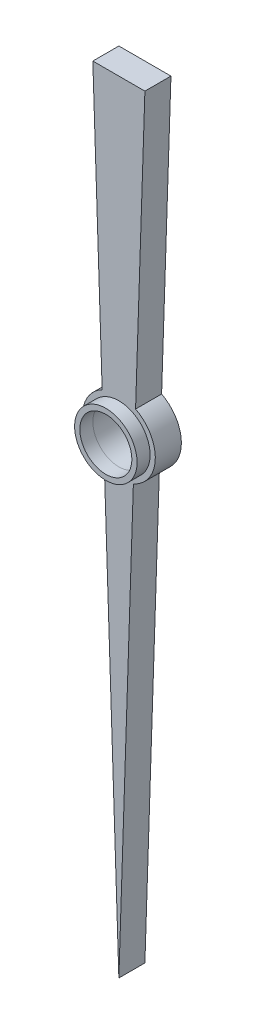
ISO-10303-21;
HEADER;
FILE_DESCRIPTION(('STEP AP214'),'2;1');
FILE_NAME('part.step','',(''),(''),'','','');
FILE_SCHEMA(('AUTOMOTIVE_DESIGN { 1 0 10303 214 1 1 1 1 }'));
ENDSEC;
DATA;
#1=APPLICATION_CONTEXT('core data for automotive mechanical design processes');
#2=APPLICATION_PROTOCOL_DEFINITION('international standard','automotive_design',2000,#1);
#3=PRODUCT_CONTEXT('',#1,'mechanical');
#4=PRODUCT('Part','Part','',(#3));
#5=PRODUCT_RELATED_PRODUCT_CATEGORY('part','',(#4));
#6=PRODUCT_DEFINITION_FORMATION('','',#4);
#7=PRODUCT_DEFINITION_CONTEXT('part definition',#1,'design');
#8=PRODUCT_DEFINITION('design','',#6,#7);
#9=PRODUCT_DEFINITION_SHAPE('','',#8);
#10=(LENGTH_UNIT() NAMED_UNIT(*) SI_UNIT(.MILLI.,.METRE.));
#11=(NAMED_UNIT(*) PLANE_ANGLE_UNIT() SI_UNIT($,.RADIAN.));
#12=(NAMED_UNIT(*) SI_UNIT($,.STERADIAN.) SOLID_ANGLE_UNIT());
#13=UNCERTAINTY_MEASURE_WITH_UNIT(LENGTH_MEASURE(1.E-05),#10,'distance_accuracy_value','');
#14=(GEOMETRIC_REPRESENTATION_CONTEXT(3) GLOBAL_UNCERTAINTY_ASSIGNED_CONTEXT((#13)) GLOBAL_UNIT_ASSIGNED_CONTEXT((#10,
#11,#12)) REPRESENTATION_CONTEXT('',''));
#15=CARTESIAN_POINT('',(0.,0.,0.));
#16=DIRECTION('',(0.,0.,1.));
#17=DIRECTION('',(1.,0.,0.));
#18=AXIS2_PLACEMENT_3D('',#15,#16,#17);
#19=CARTESIAN_POINT('',(0.,18.,1.));
#20=DIRECTION('',(0.,0.,1.));
#21=DIRECTION('',(1.,0.,0.));
#22=AXIS2_PLACEMENT_3D('',#19,#20,#21);
#23=PLANE('',#22);
#24=CARTESIAN_POINT('',(0.,18.,1.));
#25=DIRECTION('',(0.,0.,1.));
#26=DIRECTION('',(1.,0.,0.));
#27=AXIS2_PLACEMENT_3D('',#24,#25,#26);
#28=CIRCLE('',#27,1.2);
#29=CARTESIAN_POINT('',(1.2,18.,1.));
#30=VERTEX_POINT('',#29);
#31=EDGE_CURVE('E170',#30,#30,#28,.T.);
#32=ORIENTED_EDGE('',*,*,#31,.F.);
#33=EDGE_LOOP('',(#32));
#34=FACE_BOUND('',#33,.T.);
#35=DIRECTION('',(0.0333148302326385,0.999444906979154,0.));
#36=VECTOR('',#35,1.);
#37=CARTESIAN_POINT('',(0.557188514530755,16.7156554359227,1.));
#38=LINE('',#37,#36);
#39=CARTESIAN_POINT('',(0.,0.,1.));
#40=VERTEX_POINT('',#39);
#41=CARTESIAN_POINT('',(0.557188514530755,16.7156554359227,1.));
#42=VERTEX_POINT('',#41);
#43=EDGE_CURVE('E141',#40,#42,#38,.T.);
#44=ORIENTED_EDGE('',*,*,#43,.T.);
#45=CARTESIAN_POINT('',(0.,18.,1.));
#46=DIRECTION('',(0.,0.,1.));
#47=DIRECTION('',(1.,0.,0.));
#48=AXIS2_PLACEMENT_3D('',#45,#46,#47);
#49=CIRCLE('',#48,1.4);
#50=CARTESIAN_POINT('',(0.641479631973129,19.2443889591939,1.));
#51=VERTEX_POINT('',#50);
#52=EDGE_CURVE('E94',#42,#51,#49,.T.);
#53=ORIENTED_EDGE('',*,*,#52,.T.);
#54=DIRECTION('',(0.0333148302326385,0.999444906979154,0.));
#55=VECTOR('',#54,1.);
#56=CARTESIAN_POINT('',(1.,30.,1.));
#57=LINE('',#56,#55);
#58=CARTESIAN_POINT('',(1.,30.,1.));
#59=VERTEX_POINT('',#58);
#60=EDGE_CURVE('E153',#51,#59,#57,.T.);
#61=ORIENTED_EDGE('',*,*,#60,.T.);
#62=DIRECTION('',(-1.,0.,0.));
#63=VECTOR('',#62,1.);
#64=CARTESIAN_POINT('',(0.,30.,1.));
#65=LINE('',#64,#63);
#66=CARTESIAN_POINT('',(-1.,30.,1.));
#67=VERTEX_POINT('',#66);
#68=EDGE_CURVE('E109',#59,#67,#65,.T.);
#69=ORIENTED_EDGE('',*,*,#68,.T.);
#70=DIRECTION('',(0.0333148302326385,-0.999444906979154,0.));
#71=VECTOR('',#70,1.);
#72=CARTESIAN_POINT('',(-1.,30.,1.));
#73=LINE('',#72,#71);
#74=CARTESIAN_POINT('',(-0.64147963197313,19.2443889591939,1.));
#75=VERTEX_POINT('',#74);
#76=EDGE_CURVE('E104',#67,#75,#73,.T.);
#77=ORIENTED_EDGE('',*,*,#76,.T.);
#78=CARTESIAN_POINT('',(0.,18.,1.));
#79=DIRECTION('',(0.,0.,1.));
#80=DIRECTION('',(1.,0.,0.));
#81=AXIS2_PLACEMENT_3D('',#78,#79,#80);
#82=CIRCLE('',#81,1.4);
#83=CARTESIAN_POINT('',(-0.557188514530755,16.7156554359227,1.));
#84=VERTEX_POINT('',#83);
#85=EDGE_CURVE('E107',#75,#84,#82,.T.);
#86=ORIENTED_EDGE('',*,*,#85,.T.);
#87=DIRECTION('',(0.0333148302326385,-0.999444906979154,0.));
#88=VECTOR('',#87,1.);
#89=CARTESIAN_POINT('',(-0.557188514530755,16.7156554359227,1.));
#90=LINE('',#89,#88);
#91=EDGE_CURVE('E54',#84,#40,#90,.T.);
#92=ORIENTED_EDGE('',*,*,#91,.T.);
#93=EDGE_LOOP('',(#44,#53,#61,#69,#77,#86,#92));
#94=FACE_BOUND('',#93,.T.);
#95=ADVANCED_FACE('F37',(#34,#94),#23,.T.);
#96=CARTESIAN_POINT('',(0.,18.,0.));
#97=DIRECTION('',(0.,0.,1.));
#98=DIRECTION('',(1.,0.,0.));
#99=AXIS2_PLACEMENT_3D('',#96,#97,#98);
#100=PLANE('',#99);
#101=DIRECTION('',(0.0333148302326385,0.999444906979154,0.));
#102=VECTOR('',#101,1.);
#103=CARTESIAN_POINT('',(0.557188514530755,16.7156554359227,0.));
#104=LINE('',#103,#102);
#105=CARTESIAN_POINT('',(0.,0.,0.));
#106=VERTEX_POINT('',#105);
#107=CARTESIAN_POINT('',(0.557188514530755,16.7156554359227,0.));
#108=VERTEX_POINT('',#107);
#109=EDGE_CURVE('E127',#106,#108,#104,.T.);
#110=ORIENTED_EDGE('',*,*,#109,.F.);
#111=DIRECTION('',(0.0333148302326385,-0.999444906979154,0.));
#112=VECTOR('',#111,1.);
#113=CARTESIAN_POINT('',(-0.557188514530755,16.7156554359227,0.));
#114=LINE('',#113,#112);
#115=CARTESIAN_POINT('',(-0.557188514530755,16.7156554359227,0.));
#116=VERTEX_POINT('',#115);
#117=EDGE_CURVE('E86',#116,#106,#114,.T.);
#118=ORIENTED_EDGE('',*,*,#117,.F.);
#119=CARTESIAN_POINT('',(0.,18.,0.));
#120=DIRECTION('',(0.,0.,1.));
#121=DIRECTION('',(1.,0.,0.));
#122=AXIS2_PLACEMENT_3D('',#119,#120,#121);
#123=CIRCLE('',#122,1.4);
#124=CARTESIAN_POINT('',(-0.64147963197313,19.2443889591939,0.));
#125=VERTEX_POINT('',#124);
#126=EDGE_CURVE('E80',#125,#116,#123,.T.);
#127=ORIENTED_EDGE('',*,*,#126,.F.);
#128=DIRECTION('',(0.0333148302326385,-0.999444906979154,0.));
#129=VECTOR('',#128,1.);
#130=CARTESIAN_POINT('',(-1.,30.,0.));
#131=LINE('',#130,#129);
#132=CARTESIAN_POINT('',(-1.,30.,0.));
#133=VERTEX_POINT('',#132);
#134=EDGE_CURVE('E117',#133,#125,#131,.T.);
#135=ORIENTED_EDGE('',*,*,#134,.F.);
#136=DIRECTION('',(-1.,0.,0.));
#137=VECTOR('',#136,1.);
#138=CARTESIAN_POINT('',(0.,30.,0.));
#139=LINE('',#138,#137);
#140=CARTESIAN_POINT('',(1.,30.,0.));
#141=VERTEX_POINT('',#140);
#142=EDGE_CURVE('E136',#141,#133,#139,.T.);
#143=ORIENTED_EDGE('',*,*,#142,.F.);
#144=DIRECTION('',(0.0333148302326385,0.999444906979154,0.));
#145=VECTOR('',#144,1.);
#146=CARTESIAN_POINT('',(1.,30.,0.));
#147=LINE('',#146,#145);
#148=CARTESIAN_POINT('',(0.641479631973129,19.2443889591939,0.));
#149=VERTEX_POINT('',#148);
#150=EDGE_CURVE('E133',#149,#141,#147,.T.);
#151=ORIENTED_EDGE('',*,*,#150,.F.);
#152=CARTESIAN_POINT('',(0.,18.,0.));
#153=DIRECTION('',(0.,0.,1.));
#154=DIRECTION('',(1.,0.,0.));
#155=AXIS2_PLACEMENT_3D('',#152,#153,#154);
#156=CIRCLE('',#155,1.4);
#157=EDGE_CURVE('E130',#108,#149,#156,.T.);
#158=ORIENTED_EDGE('',*,*,#157,.F.);
#159=EDGE_LOOP('',(#110,#118,#127,#135,#143,#151,#158));
#160=FACE_BOUND('',#159,.T.);
#161=CARTESIAN_POINT('',(0.,18.,0.));
#162=DIRECTION('',(0.,0.,1.));
#163=DIRECTION('',(1.,0.,0.));
#164=AXIS2_PLACEMENT_3D('',#161,#162,#163);
#165=CIRCLE('',#164,1.);
#166=CARTESIAN_POINT('',(1.,18.,0.));
#167=VERTEX_POINT('',#166);
#168=EDGE_CURVE('E131',#167,#167,#165,.T.);
#169=ORIENTED_EDGE('',*,*,#168,.T.);
#170=EDGE_LOOP('',(#169));
#171=FACE_BOUND('',#170,.T.);
#172=ADVANCED_FACE('F156',(#160,#171),#100,.F.);
#173=CARTESIAN_POINT('',(0.557188514530755,16.7156554359227,1.));
#174=DIRECTION('',(-0.999444906979154,0.0333148302326385,0.));
#175=DIRECTION('',(-0.0333148302326385,-0.999444906979154,0.));
#176=AXIS2_PLACEMENT_3D('',#173,#174,#175);
#177=PLANE('',#176);
#178=ORIENTED_EDGE('',*,*,#109,.T.);
#179=DIRECTION('',(0.,0.,-1.));
#180=VECTOR('',#179,1.);
#181=CARTESIAN_POINT('',(0.557188514530755,16.7156554359227,1.));
#182=LINE('',#181,#180);
#183=EDGE_CURVE('E11',#42,#108,#182,.T.);
#184=ORIENTED_EDGE('',*,*,#183,.F.);
#185=ORIENTED_EDGE('',*,*,#43,.F.);
#186=DIRECTION('',(0.,0.,-1.));
#187=VECTOR('',#186,1.);
#188=CARTESIAN_POINT('',(0.,0.,1.));
#189=LINE('',#188,#187);
#190=EDGE_CURVE('E123',#40,#106,#189,.T.);
#191=ORIENTED_EDGE('',*,*,#190,.T.);
#192=EDGE_LOOP('',(#178,#184,#185,#191));
#193=FACE_BOUND('',#192,.T.);
#194=ADVANCED_FACE('F39',(#193),#177,.F.);
#195=CARTESIAN_POINT('',(0.,18.,1.));
#196=DIRECTION('',(0.,0.,-1.));
#197=DIRECTION('',(-1.,0.,0.));
#198=AXIS2_PLACEMENT_3D('',#195,#196,#197);
#199=CYLINDRICAL_SURFACE('',#198,1.4);
#200=ORIENTED_EDGE('',*,*,#157,.T.);
#201=DIRECTION('',(0.,0.,-1.));
#202=VECTOR('',#201,1.);
#203=CARTESIAN_POINT('',(0.641479631973129,19.2443889591939,1.));
#204=LINE('',#203,#202);
#205=EDGE_CURVE('E46',#51,#149,#204,.T.);
#206=ORIENTED_EDGE('',*,*,#205,.F.);
#207=ORIENTED_EDGE('',*,*,#52,.F.);
#208=ORIENTED_EDGE('',*,*,#183,.T.);
#209=EDGE_LOOP('',(#200,#206,#207,#208));
#210=FACE_BOUND('',#209,.T.);
#211=ADVANCED_FACE('F223',(#210),#199,.T.);
#212=CARTESIAN_POINT('',(1.,30.,1.));
#213=DIRECTION('',(-0.999444906979154,0.0333148302326385,0.));
#214=DIRECTION('',(-0.0333148302326385,-0.999444906979154,0.));
#215=AXIS2_PLACEMENT_3D('',#212,#213,#214);
#216=PLANE('',#215);
#217=ORIENTED_EDGE('',*,*,#150,.T.);
#218=DIRECTION('',(0.,0.,-1.));
#219=VECTOR('',#218,1.);
#220=CARTESIAN_POINT('',(1.,30.,1.));
#221=LINE('',#220,#219);
#222=EDGE_CURVE('E145',#59,#141,#221,.T.);
#223=ORIENTED_EDGE('',*,*,#222,.F.);
#224=ORIENTED_EDGE('',*,*,#60,.F.);
#225=ORIENTED_EDGE('',*,*,#205,.T.);
#226=EDGE_LOOP('',(#217,#223,#224,#225));
#227=FACE_BOUND('',#226,.T.);
#228=ADVANCED_FACE('F151',(#227),#216,.F.);
#229=CARTESIAN_POINT('',(0.,30.,1.));
#230=DIRECTION('',(0.,-1.,0.));
#231=DIRECTION('',(0.,0.,-1.));
#232=AXIS2_PLACEMENT_3D('',#229,#230,#231);
#233=PLANE('',#232);
#234=ORIENTED_EDGE('',*,*,#142,.T.);
#235=DIRECTION('',(0.,0.,-1.));
#236=VECTOR('',#235,1.);
#237=CARTESIAN_POINT('',(-1.,30.,1.));
#238=LINE('',#237,#236);
#239=EDGE_CURVE('E118',#67,#133,#238,.T.);
#240=ORIENTED_EDGE('',*,*,#239,.F.);
#241=ORIENTED_EDGE('',*,*,#68,.F.);
#242=ORIENTED_EDGE('',*,*,#222,.T.);
#243=EDGE_LOOP('',(#234,#240,#241,#242));
#244=FACE_BOUND('',#243,.T.);
#245=ADVANCED_FACE('F159',(#244),#233,.F.);
#246=CARTESIAN_POINT('',(-1.,30.,1.));
#247=DIRECTION('',(0.999444906979154,0.0333148302326385,0.));
#248=DIRECTION('',(-0.0333148302326385,0.999444906979154,0.));
#249=AXIS2_PLACEMENT_3D('',#246,#247,#248);
#250=PLANE('',#249);
#251=ORIENTED_EDGE('',*,*,#134,.T.);
#252=DIRECTION('',(0.,0.,-1.));
#253=VECTOR('',#252,1.);
#254=CARTESIAN_POINT('',(-0.64147963197313,19.2443889591939,1.));
#255=LINE('',#254,#253);
#256=EDGE_CURVE('E114',#75,#125,#255,.T.);
#257=ORIENTED_EDGE('',*,*,#256,.F.);
#258=ORIENTED_EDGE('',*,*,#76,.F.);
#259=ORIENTED_EDGE('',*,*,#239,.T.);
#260=EDGE_LOOP('',(#251,#257,#258,#259));
#261=FACE_BOUND('',#260,.T.);
#262=ADVANCED_FACE('F115',(#261),#250,.F.);
#263=CARTESIAN_POINT('',(0.,18.,1.));
#264=DIRECTION('',(0.,0.,-1.));
#265=DIRECTION('',(-1.,0.,0.));
#266=AXIS2_PLACEMENT_3D('',#263,#264,#265);
#267=CYLINDRICAL_SURFACE('',#266,1.4);
#268=ORIENTED_EDGE('',*,*,#126,.T.);
#269=DIRECTION('',(0.,0.,-1.));
#270=VECTOR('',#269,1.);
#271=CARTESIAN_POINT('',(-0.557188514530755,16.7156554359227,1.));
#272=LINE('',#271,#270);
#273=EDGE_CURVE('E119',#84,#116,#272,.T.);
#274=ORIENTED_EDGE('',*,*,#273,.F.);
#275=ORIENTED_EDGE('',*,*,#85,.F.);
#276=ORIENTED_EDGE('',*,*,#256,.T.);
#277=EDGE_LOOP('',(#268,#274,#275,#276));
#278=FACE_BOUND('',#277,.T.);
#279=ADVANCED_FACE('F121',(#278),#267,.T.);
#280=CARTESIAN_POINT('',(-0.557188514530755,16.7156554359227,1.));
#281=DIRECTION('',(0.999444906979154,0.0333148302326385,0.));
#282=DIRECTION('',(-0.0333148302326385,0.999444906979154,0.));
#283=AXIS2_PLACEMENT_3D('',#280,#281,#282);
#284=PLANE('',#283);
#285=ORIENTED_EDGE('',*,*,#117,.T.);
#286=ORIENTED_EDGE('',*,*,#190,.F.);
#287=ORIENTED_EDGE('',*,*,#91,.F.);
#288=ORIENTED_EDGE('',*,*,#273,.T.);
#289=EDGE_LOOP('',(#285,#286,#287,#288));
#290=FACE_BOUND('',#289,.T.);
#291=ADVANCED_FACE('F213',(#290),#284,.F.);
#292=CARTESIAN_POINT('',(0.,18.,1.));
#293=DIRECTION('',(0.,0.,-1.));
#294=DIRECTION('',(-1.,0.,0.));
#295=AXIS2_PLACEMENT_3D('',#292,#293,#294);
#296=CYLINDRICAL_SURFACE('',#295,1.);
#297=CARTESIAN_POINT('',(0.,18.,1.));
#298=DIRECTION('',(0.,0.,1.));
#299=DIRECTION('',(1.,0.,0.));
#300=AXIS2_PLACEMENT_3D('',#297,#298,#299);
#301=CIRCLE('',#300,1.);
#302=CARTESIAN_POINT('',(1.,18.,1.));
#303=VERTEX_POINT('',#302);
#304=EDGE_CURVE('E166',#303,#303,#301,.T.);
#305=ORIENTED_EDGE('',*,*,#304,.T.);
#306=EDGE_LOOP('',(#305));
#307=FACE_BOUND('',#306,.T.);
#308=ORIENTED_EDGE('',*,*,#168,.F.);
#309=EDGE_LOOP('',(#308));
#310=FACE_BOUND('',#309,.T.);
#311=ADVANCED_FACE('F197',(#307,#310),#296,.F.);
#312=CARTESIAN_POINT('',(0.,18.,1.));
#313=DIRECTION('',(0.,0.,1.));
#314=DIRECTION('',(1.,0.,0.));
#315=AXIS2_PLACEMENT_3D('',#312,#313,#314);
#316=PLANE('',#315);
#317=CARTESIAN_POINT('',(0.,18.,1.));
#318=DIRECTION('',(0.,0.,1.));
#319=DIRECTION('',(1.,0.,0.));
#320=AXIS2_PLACEMENT_3D('',#317,#318,#319);
#321=CIRCLE('',#320,0.999056936111742);
#322=CARTESIAN_POINT('',(0.999056936111744,18.,1.));
#323=VERTEX_POINT('',#322);
#324=EDGE_CURVE('E176',#323,#323,#321,.T.);
#325=ORIENTED_EDGE('',*,*,#324,.T.);
#326=EDGE_LOOP('',(#325));
#327=FACE_BOUND('',#326,.T.);
#328=ORIENTED_EDGE('',*,*,#304,.F.);
#329=EDGE_LOOP('',(#328));
#330=FACE_BOUND('',#329,.T.);
#331=ADVANCED_FACE('F188',(#327,#330),#316,.F.);
#332=CARTESIAN_POINT('',(0.,18.,1.5));
#333=DIRECTION('',(0.,0.,1.));
#334=DIRECTION('',(1.,0.,0.));
#335=AXIS2_PLACEMENT_3D('',#332,#333,#334);
#336=PLANE('',#335);
#337=CARTESIAN_POINT('',(0.,18.,1.5));
#338=DIRECTION('',(0.,0.,1.));
#339=DIRECTION('',(1.,0.,0.));
#340=AXIS2_PLACEMENT_3D('',#337,#338,#339);
#341=CIRCLE('',#340,1.2);
#342=CARTESIAN_POINT('',(1.2,18.,1.5));
#343=VERTEX_POINT('',#342);
#344=EDGE_CURVE('E169',#343,#343,#341,.T.);
#345=ORIENTED_EDGE('',*,*,#344,.T.);
#346=EDGE_LOOP('',(#345));
#347=FACE_BOUND('',#346,.T.);
#348=CARTESIAN_POINT('',(0.,18.,1.5));
#349=DIRECTION('',(0.,0.,1.));
#350=DIRECTION('',(1.,0.,0.));
#351=AXIS2_PLACEMENT_3D('',#348,#349,#350);
#352=CIRCLE('',#351,0.999056936111742);
#353=CARTESIAN_POINT('',(0.999056936111744,18.,1.5));
#354=VERTEX_POINT('',#353);
#355=EDGE_CURVE('E173',#354,#354,#352,.T.);
#356=ORIENTED_EDGE('',*,*,#355,.F.);
#357=EDGE_LOOP('',(#356));
#358=FACE_BOUND('',#357,.T.);
#359=ADVANCED_FACE('F185',(#347,#358),#336,.T.);
#360=CARTESIAN_POINT('',(0.,18.,1.5));
#361=DIRECTION('',(0.,0.,-1.));
#362=DIRECTION('',(-1.,0.,0.));
#363=AXIS2_PLACEMENT_3D('',#360,#361,#362);
#364=CYLINDRICAL_SURFACE('',#363,1.2);
#365=ORIENTED_EDGE('',*,*,#344,.F.);
#366=EDGE_LOOP('',(#365));
#367=FACE_BOUND('',#366,.T.);
#368=ORIENTED_EDGE('',*,*,#31,.T.);
#369=EDGE_LOOP('',(#368));
#370=FACE_BOUND('',#369,.T.);
#371=ADVANCED_FACE('F187',(#367,#370),#364,.T.);
#372=CARTESIAN_POINT('',(0.,18.,1.5));
#373=DIRECTION('',(0.,0.,-1.));
#374=DIRECTION('',(-1.,0.,0.));
#375=AXIS2_PLACEMENT_3D('',#372,#373,#374);
#376=CYLINDRICAL_SURFACE('',#375,0.999056936111742);
#377=ORIENTED_EDGE('',*,*,#355,.T.);
#378=EDGE_LOOP('',(#377));
#379=FACE_BOUND('',#378,.T.);
#380=ORIENTED_EDGE('',*,*,#324,.F.);
#381=EDGE_LOOP('',(#380));
#382=FACE_BOUND('',#381,.T.);
#383=ADVANCED_FACE('F182',(#379,#382),#376,.F.);
#384=CLOSED_SHELL('',(#95,#172,#194,#211,#228,#245,#262,#279,#291,#311,#331,#359,#371,#383));
#385=MANIFOLD_SOLID_BREP('B2',#384);
#386=ADVANCED_BREP_SHAPE_REPRESENTATION('',(#18,#385),#14);
#387=SHAPE_DEFINITION_REPRESENTATION(#9,#386);
ENDSEC;
END-ISO-10303-21;
